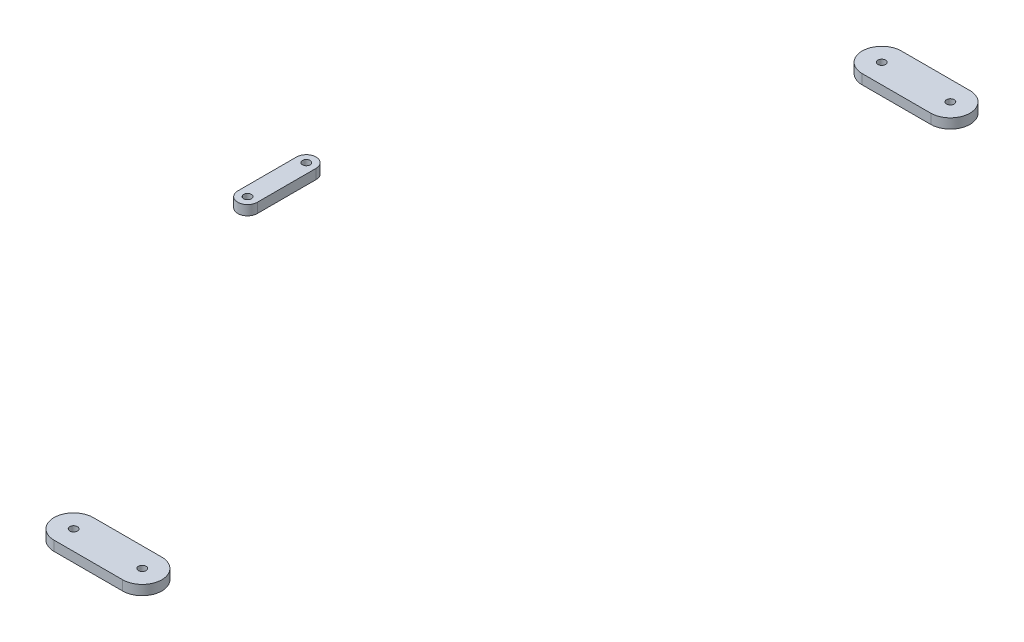
ISO-10303-21;
HEADER;
FILE_DESCRIPTION(('STEP AP214'),'2;1');
FILE_NAME('part.step','',(''),(''),'','','');
FILE_SCHEMA(('AUTOMOTIVE_DESIGN { 1 0 10303 214 1 1 1 1 }'));
ENDSEC;
DATA;
#1=APPLICATION_CONTEXT('core data for automotive mechanical design processes');
#2=APPLICATION_PROTOCOL_DEFINITION('international standard','automotive_design',2000,#1);
#3=PRODUCT_CONTEXT('',#1,'mechanical');
#4=PRODUCT('Part','Part','',(#3));
#5=PRODUCT_RELATED_PRODUCT_CATEGORY('part','',(#4));
#6=PRODUCT_DEFINITION_FORMATION('','',#4);
#7=PRODUCT_DEFINITION_CONTEXT('part definition',#1,'design');
#8=PRODUCT_DEFINITION('design','',#6,#7);
#9=PRODUCT_DEFINITION_SHAPE('','',#8);
#10=(LENGTH_UNIT() NAMED_UNIT(*) SI_UNIT(.MILLI.,.METRE.));
#11=(NAMED_UNIT(*) PLANE_ANGLE_UNIT() SI_UNIT($,.RADIAN.));
#12=(NAMED_UNIT(*) SI_UNIT($,.STERADIAN.) SOLID_ANGLE_UNIT());
#13=UNCERTAINTY_MEASURE_WITH_UNIT(LENGTH_MEASURE(1.E-05),#10,'distance_accuracy_value','');
#14=(GEOMETRIC_REPRESENTATION_CONTEXT(3) GLOBAL_UNCERTAINTY_ASSIGNED_CONTEXT((#13)) GLOBAL_UNIT_ASSIGNED_CONTEXT((#10,
#11,#12)) REPRESENTATION_CONTEXT('',''));
#15=CARTESIAN_POINT('',(0.,0.,0.));
#16=DIRECTION('',(0.,0.,1.));
#17=DIRECTION('',(1.,0.,0.));
#18=AXIS2_PLACEMENT_3D('',#15,#16,#17);
#19=CARTESIAN_POINT('',(0.,-342.9,-249.2375));
#20=DIRECTION('',(0.,0.,1.));
#21=DIRECTION('',(-1.,0.,0.));
#22=AXIS2_PLACEMENT_3D('',#19,#20,#21);
#23=PLANE('',#22);
#24=DIRECTION('',(-1.,0.,0.));
#25=VECTOR('',#24,1.);
#26=CARTESIAN_POINT('',(0.,-336.55,-249.2375));
#27=LINE('',#26,#25);
#28=CARTESIAN_POINT('',(174.625,-336.55,-249.2375));
#29=VERTEX_POINT('',#28);
#30=CARTESIAN_POINT('',(130.175,-336.55,-249.2375));
#31=VERTEX_POINT('',#30);
#32=EDGE_CURVE('E112',#29,#31,#27,.T.);
#33=ORIENTED_EDGE('',*,*,#32,.T.);
#34=DIRECTION('',(0.,1.,0.));
#35=VECTOR('',#34,1.);
#36=CARTESIAN_POINT('',(130.175,-342.9,-249.2375));
#37=LINE('',#36,#35);
#38=CARTESIAN_POINT('',(130.175,-342.9,-249.2375));
#39=VERTEX_POINT('',#38);
#40=EDGE_CURVE('E51',#39,#31,#37,.T.);
#41=ORIENTED_EDGE('',*,*,#40,.F.);
#42=DIRECTION('',(-1.,0.,0.));
#43=VECTOR('',#42,1.);
#44=CARTESIAN_POINT('',(0.,-342.9,-249.2375));
#45=LINE('',#44,#43);
#46=CARTESIAN_POINT('',(174.625,-342.9,-249.2375));
#47=VERTEX_POINT('',#46);
#48=EDGE_CURVE('E101',#47,#39,#45,.T.);
#49=ORIENTED_EDGE('',*,*,#48,.F.);
#50=DIRECTION('',(0.,1.,0.));
#51=VECTOR('',#50,1.);
#52=CARTESIAN_POINT('',(174.625,-342.9,-249.2375));
#53=LINE('',#52,#51);
#54=EDGE_CURVE('E12',#47,#29,#53,.T.);
#55=ORIENTED_EDGE('',*,*,#54,.T.);
#56=EDGE_LOOP('',(#33,#41,#49,#55));
#57=FACE_BOUND('',#56,.T.);
#58=ADVANCED_FACE('F48',(#57),#23,.T.);
#59=CARTESIAN_POINT('',(174.625,-342.9,-261.9375));
#60=DIRECTION('',(0.,1.,0.));
#61=DIRECTION('',(0.,0.,-1.));
#62=AXIS2_PLACEMENT_3D('',#59,#60,#61);
#63=CYLINDRICAL_SURFACE('',#62,12.7);
#64=CARTESIAN_POINT('',(174.625,-336.55,-261.9375));
#65=DIRECTION('',(0.,-1.,0.));
#66=DIRECTION('',(0.,0.,-1.));
#67=AXIS2_PLACEMENT_3D('',#64,#65,#66);
#68=CIRCLE('',#67,12.7);
#69=CARTESIAN_POINT('',(174.625,-336.55,-274.6375));
#70=VERTEX_POINT('',#69);
#71=EDGE_CURVE('E89',#70,#29,#68,.T.);
#72=ORIENTED_EDGE('',*,*,#71,.T.);
#73=ORIENTED_EDGE('',*,*,#54,.F.);
#74=CARTESIAN_POINT('',(174.625,-342.9,-261.9375));
#75=DIRECTION('',(0.,-1.,0.));
#76=DIRECTION('',(0.,0.,-1.));
#77=AXIS2_PLACEMENT_3D('',#74,#75,#76);
#78=CIRCLE('',#77,12.7);
#79=CARTESIAN_POINT('',(174.625,-342.9,-274.6375));
#80=VERTEX_POINT('',#79);
#81=EDGE_CURVE('E66',#80,#47,#78,.T.);
#82=ORIENTED_EDGE('',*,*,#81,.F.);
#83=DIRECTION('',(0.,1.,0.));
#84=VECTOR('',#83,1.);
#85=CARTESIAN_POINT('',(174.625,-342.9,-274.6375));
#86=LINE('',#85,#84);
#87=EDGE_CURVE('E57',#80,#70,#86,.T.);
#88=ORIENTED_EDGE('',*,*,#87,.T.);
#89=EDGE_LOOP('',(#72,#73,#82,#88));
#90=FACE_BOUND('',#89,.T.);
#91=ADVANCED_FACE('F119',(#90),#63,.T.);
#92=CARTESIAN_POINT('',(0.,-342.9,-274.6375));
#93=DIRECTION('',(0.,0.,1.));
#94=DIRECTION('',(-1.,0.,0.));
#95=AXIS2_PLACEMENT_3D('',#92,#93,#94);
#96=PLANE('',#95);
#97=DIRECTION('',(-1.,0.,0.));
#98=VECTOR('',#97,1.);
#99=CARTESIAN_POINT('',(0.,-336.55,-274.6375));
#100=LINE('',#99,#98);
#101=CARTESIAN_POINT('',(130.175,-336.55,-274.6375));
#102=VERTEX_POINT('',#101);
#103=EDGE_CURVE('E83',#70,#102,#100,.T.);
#104=ORIENTED_EDGE('',*,*,#103,.F.);
#105=ORIENTED_EDGE('',*,*,#87,.F.);
#106=DIRECTION('',(-1.,0.,0.));
#107=VECTOR('',#106,1.);
#108=CARTESIAN_POINT('',(0.,-342.9,-274.6375));
#109=LINE('',#108,#107);
#110=CARTESIAN_POINT('',(130.175,-342.9,-274.6375));
#111=VERTEX_POINT('',#110);
#112=EDGE_CURVE('E99',#80,#111,#109,.T.);
#113=ORIENTED_EDGE('',*,*,#112,.T.);
#114=DIRECTION('',(0.,1.,0.));
#115=VECTOR('',#114,1.);
#116=CARTESIAN_POINT('',(130.175,-342.9,-274.6375));
#117=LINE('',#116,#115);
#118=EDGE_CURVE('E104',#111,#102,#117,.T.);
#119=ORIENTED_EDGE('',*,*,#118,.T.);
#120=EDGE_LOOP('',(#104,#105,#113,#119));
#121=FACE_BOUND('',#120,.T.);
#122=ADVANCED_FACE('F107',(#121),#96,.F.);
#123=CARTESIAN_POINT('',(130.175,-342.9,-261.9375));
#124=DIRECTION('',(0.,1.,0.));
#125=DIRECTION('',(0.,0.,-1.));
#126=AXIS2_PLACEMENT_3D('',#123,#124,#125);
#127=CYLINDRICAL_SURFACE('',#126,12.7);
#128=CARTESIAN_POINT('',(130.175,-336.55,-261.9375));
#129=DIRECTION('',(0.,-1.,0.));
#130=DIRECTION('',(0.,0.,-1.));
#131=AXIS2_PLACEMENT_3D('',#128,#129,#130);
#132=CIRCLE('',#131,12.7);
#133=EDGE_CURVE('E106',#31,#102,#132,.T.);
#134=ORIENTED_EDGE('',*,*,#133,.T.);
#135=ORIENTED_EDGE('',*,*,#118,.F.);
#136=CARTESIAN_POINT('',(130.175,-342.9,-261.9375));
#137=DIRECTION('',(0.,-1.,0.));
#138=DIRECTION('',(0.,0.,-1.));
#139=AXIS2_PLACEMENT_3D('',#136,#137,#138);
#140=CIRCLE('',#139,12.7);
#141=EDGE_CURVE('E96',#39,#111,#140,.T.);
#142=ORIENTED_EDGE('',*,*,#141,.F.);
#143=ORIENTED_EDGE('',*,*,#40,.T.);
#144=EDGE_LOOP('',(#134,#135,#142,#143));
#145=FACE_BOUND('',#144,.T.);
#146=ADVANCED_FACE('F105',(#145),#127,.T.);
#147=CARTESIAN_POINT('',(0.,-342.9,0.));
#148=DIRECTION('',(0.,1.,0.));
#149=DIRECTION('',(0.,0.,-1.));
#150=AXIS2_PLACEMENT_3D('',#147,#148,#149);
#151=PLANE('',#150);
#152=CARTESIAN_POINT('',(174.625,-342.9,-261.9375));
#153=DIRECTION('',(0.,1.,0.));
#154=DIRECTION('',(0.,0.,1.));
#155=AXIS2_PLACEMENT_3D('',#152,#153,#154);
#156=CIRCLE('',#155,2.4892);
#157=CARTESIAN_POINT('',(174.625,-342.9,-259.4483));
#158=VERTEX_POINT('',#157);
#159=EDGE_CURVE('E130',#158,#158,#156,.T.);
#160=ORIENTED_EDGE('',*,*,#159,.T.);
#161=EDGE_LOOP('',(#160));
#162=FACE_BOUND('',#161,.T.);
#163=CARTESIAN_POINT('',(130.175,-342.9,-261.9375));
#164=DIRECTION('',(0.,1.,0.));
#165=DIRECTION('',(0.,0.,1.));
#166=AXIS2_PLACEMENT_3D('',#163,#164,#165);
#167=CIRCLE('',#166,2.4892);
#168=CARTESIAN_POINT('',(130.175,-342.9,-259.4483));
#169=VERTEX_POINT('',#168);
#170=EDGE_CURVE('E115',#169,#169,#167,.T.);
#171=ORIENTED_EDGE('',*,*,#170,.T.);
#172=EDGE_LOOP('',(#171));
#173=FACE_BOUND('',#172,.T.);
#174=ORIENTED_EDGE('',*,*,#48,.T.);
#175=ORIENTED_EDGE('',*,*,#141,.T.);
#176=ORIENTED_EDGE('',*,*,#112,.F.);
#177=ORIENTED_EDGE('',*,*,#81,.T.);
#178=EDGE_LOOP('',(#174,#175,#176,#177));
#179=FACE_BOUND('',#178,.T.);
#180=ADVANCED_FACE('F97',(#162,#173,#179),#151,.F.);
#181=CARTESIAN_POINT('',(0.,-336.55,0.));
#182=DIRECTION('',(0.,1.,0.));
#183=DIRECTION('',(0.,0.,-1.));
#184=AXIS2_PLACEMENT_3D('',#181,#182,#183);
#185=PLANE('',#184);
#186=CARTESIAN_POINT('',(174.625,-336.55,-261.9375));
#187=DIRECTION('',(0.,1.,0.));
#188=DIRECTION('',(0.,0.,1.));
#189=AXIS2_PLACEMENT_3D('',#186,#187,#188);
#190=CIRCLE('',#189,2.4892);
#191=CARTESIAN_POINT('',(174.625,-336.55,-259.4483));
#192=VERTEX_POINT('',#191);
#193=EDGE_CURVE('E133',#192,#192,#190,.T.);
#194=ORIENTED_EDGE('',*,*,#193,.F.);
#195=EDGE_LOOP('',(#194));
#196=FACE_BOUND('',#195,.T.);
#197=CARTESIAN_POINT('',(130.175,-336.55,-261.9375));
#198=DIRECTION('',(0.,1.,0.));
#199=DIRECTION('',(0.,0.,1.));
#200=AXIS2_PLACEMENT_3D('',#197,#198,#199);
#201=CIRCLE('',#200,2.4892);
#202=CARTESIAN_POINT('',(130.175,-336.55,-259.4483));
#203=VERTEX_POINT('',#202);
#204=EDGE_CURVE('E127',#203,#203,#201,.T.);
#205=ORIENTED_EDGE('',*,*,#204,.F.);
#206=EDGE_LOOP('',(#205));
#207=FACE_BOUND('',#206,.T.);
#208=ORIENTED_EDGE('',*,*,#32,.F.);
#209=ORIENTED_EDGE('',*,*,#71,.F.);
#210=ORIENTED_EDGE('',*,*,#103,.T.);
#211=ORIENTED_EDGE('',*,*,#133,.F.);
#212=EDGE_LOOP('',(#208,#209,#210,#211));
#213=FACE_BOUND('',#212,.T.);
#214=ADVANCED_FACE('F122',(#196,#207,#213),#185,.T.);
#215=CARTESIAN_POINT('',(130.175,-336.55,-261.9375));
#216=DIRECTION('',(0.,1.,0.));
#217=DIRECTION('',(0.,0.,1.));
#218=AXIS2_PLACEMENT_3D('',#215,#216,#217);
#219=CYLINDRICAL_SURFACE('',#218,2.4892);
#220=ORIENTED_EDGE('',*,*,#170,.F.);
#221=EDGE_LOOP('',(#220));
#222=FACE_BOUND('',#221,.T.);
#223=ORIENTED_EDGE('',*,*,#204,.T.);
#224=EDGE_LOOP('',(#223));
#225=FACE_BOUND('',#224,.T.);
#226=ADVANCED_FACE('F141',(#222,#225),#219,.F.);
#227=CARTESIAN_POINT('',(174.625,-336.55,-261.9375));
#228=DIRECTION('',(0.,1.,0.));
#229=DIRECTION('',(0.,0.,1.));
#230=AXIS2_PLACEMENT_3D('',#227,#228,#229);
#231=CYLINDRICAL_SURFACE('',#230,2.4892);
#232=ORIENTED_EDGE('',*,*,#159,.F.);
#233=EDGE_LOOP('',(#232));
#234=FACE_BOUND('',#233,.T.);
#235=ORIENTED_EDGE('',*,*,#193,.T.);
#236=EDGE_LOOP('',(#235));
#237=FACE_BOUND('',#236,.T.);
#238=ADVANCED_FACE('F137',(#234,#237),#231,.F.);
#239=CLOSED_SHELL('',(#58,#91,#122,#146,#180,#214,#226,#238));
#240=MANIFOLD_SOLID_BREP('B2',#239);
#241=CARTESIAN_POINT('',(0.,-342.9,19.05));
#242=DIRECTION('',(0.,1.,0.));
#243=DIRECTION('',(0.,0.,1.));
#244=AXIS2_PLACEMENT_3D('',#241,#242,#243);
#245=CYLINDRICAL_SURFACE('',#244,6.35);
#246=CARTESIAN_POINT('',(0.,-336.55,19.05));
#247=DIRECTION('',(0.,1.,0.));
#248=DIRECTION('',(0.,0.,1.));
#249=AXIS2_PLACEMENT_3D('',#246,#247,#248);
#250=CIRCLE('',#249,6.35);
#251=CARTESIAN_POINT('',(-6.35,-336.55,19.05));
#252=VERTEX_POINT('',#251);
#253=CARTESIAN_POINT('',(6.35,-336.55,19.05));
#254=VERTEX_POINT('',#253);
#255=EDGE_CURVE('E46',#252,#254,#250,.T.);
#256=ORIENTED_EDGE('',*,*,#255,.F.);
#257=DIRECTION('',(0.,1.,0.));
#258=VECTOR('',#257,1.);
#259=CARTESIAN_POINT('',(-6.35,-342.9,19.05));
#260=LINE('',#259,#258);
#261=CARTESIAN_POINT('',(-6.35,-342.9,19.05));
#262=VERTEX_POINT('',#261);
#263=EDGE_CURVE('E294',#262,#252,#260,.T.);
#264=ORIENTED_EDGE('',*,*,#263,.F.);
#265=CARTESIAN_POINT('',(0.,-342.9,19.05));
#266=DIRECTION('',(0.,1.,0.));
#267=DIRECTION('',(0.,0.,1.));
#268=AXIS2_PLACEMENT_3D('',#265,#266,#267);
#269=CIRCLE('',#268,6.35);
#270=CARTESIAN_POINT('',(6.35,-342.9,19.05));
#271=VERTEX_POINT('',#270);
#272=EDGE_CURVE('E251',#262,#271,#269,.T.);
#273=ORIENTED_EDGE('',*,*,#272,.T.);
#274=DIRECTION('',(0.,1.,0.));
#275=VECTOR('',#274,1.);
#276=CARTESIAN_POINT('',(6.35,-342.9,19.05));
#277=LINE('',#276,#275);
#278=EDGE_CURVE('E266',#271,#254,#277,.T.);
#279=ORIENTED_EDGE('',*,*,#278,.T.);
#280=EDGE_LOOP('',(#256,#264,#273,#279));
#281=FACE_BOUND('',#280,.T.);
#282=ADVANCED_FACE('F247',(#281),#245,.T.);
#283=CARTESIAN_POINT('',(-6.35,-342.9,19.05));
#284=DIRECTION('',(1.,0.,0.));
#285=DIRECTION('',(0.,0.,-1.));
#286=AXIS2_PLACEMENT_3D('',#283,#284,#285);
#287=PLANE('',#286);
#288=DIRECTION('',(0.,0.,-1.));
#289=VECTOR('',#288,1.);
#290=CARTESIAN_POINT('',(-6.35,-336.55,19.05));
#291=LINE('',#290,#289);
#292=CARTESIAN_POINT('',(-6.35000000000001,-336.55,-19.05));
#293=VERTEX_POINT('',#292);
#294=EDGE_CURVE('E305',#252,#293,#291,.T.);
#295=ORIENTED_EDGE('',*,*,#294,.T.);
#296=DIRECTION('',(0.,1.,0.));
#297=VECTOR('',#296,1.);
#298=CARTESIAN_POINT('',(-6.35000000000001,-342.9,-19.05));
#299=LINE('',#298,#297);
#300=CARTESIAN_POINT('',(-6.35000000000001,-342.9,-19.05));
#301=VERTEX_POINT('',#300);
#302=EDGE_CURVE('E298',#301,#293,#299,.T.);
#303=ORIENTED_EDGE('',*,*,#302,.F.);
#304=DIRECTION('',(0.,0.,-1.));
#305=VECTOR('',#304,1.);
#306=CARTESIAN_POINT('',(-6.35,-342.9,19.05));
#307=LINE('',#306,#305);
#308=EDGE_CURVE('E314',#262,#301,#307,.T.);
#309=ORIENTED_EDGE('',*,*,#308,.F.);
#310=ORIENTED_EDGE('',*,*,#263,.T.);
#311=EDGE_LOOP('',(#295,#303,#309,#310));
#312=FACE_BOUND('',#311,.T.);
#313=ADVANCED_FACE('F306',(#312),#287,.F.);
#314=CARTESIAN_POINT('',(0.,-342.9,-19.05));
#315=DIRECTION('',(0.,1.,0.));
#316=DIRECTION('',(0.,0.,1.));
#317=AXIS2_PLACEMENT_3D('',#314,#315,#316);
#318=CYLINDRICAL_SURFACE('',#317,6.35);
#319=CARTESIAN_POINT('',(0.,-336.55,-19.05));
#320=DIRECTION('',(0.,1.,0.));
#321=DIRECTION('',(0.,0.,1.));
#322=AXIS2_PLACEMENT_3D('',#319,#320,#321);
#323=CIRCLE('',#322,6.35);
#324=CARTESIAN_POINT('',(6.34999999999999,-336.55,-19.05));
#325=VERTEX_POINT('',#324);
#326=EDGE_CURVE('E301',#325,#293,#323,.T.);
#327=ORIENTED_EDGE('',*,*,#326,.F.);
#328=DIRECTION('',(0.,1.,0.));
#329=VECTOR('',#328,1.);
#330=CARTESIAN_POINT('',(6.34999999999999,-342.9,-19.05));
#331=LINE('',#330,#329);
#332=CARTESIAN_POINT('',(6.34999999999999,-342.9,-19.05));
#333=VERTEX_POINT('',#332);
#334=EDGE_CURVE('E283',#333,#325,#331,.T.);
#335=ORIENTED_EDGE('',*,*,#334,.F.);
#336=CARTESIAN_POINT('',(0.,-342.9,-19.05));
#337=DIRECTION('',(0.,1.,0.));
#338=DIRECTION('',(0.,0.,1.));
#339=AXIS2_PLACEMENT_3D('',#336,#337,#338);
#340=CIRCLE('',#339,6.35);
#341=EDGE_CURVE('E303',#333,#301,#340,.T.);
#342=ORIENTED_EDGE('',*,*,#341,.T.);
#343=ORIENTED_EDGE('',*,*,#302,.T.);
#344=EDGE_LOOP('',(#327,#335,#342,#343));
#345=FACE_BOUND('',#344,.T.);
#346=ADVANCED_FACE('F299',(#345),#318,.T.);
#347=CARTESIAN_POINT('',(6.35,-342.9,19.05));
#348=DIRECTION('',(1.,0.,0.));
#349=DIRECTION('',(0.,0.,-1.));
#350=AXIS2_PLACEMENT_3D('',#347,#348,#349);
#351=PLANE('',#350);
#352=DIRECTION('',(0.,0.,-1.));
#353=VECTOR('',#352,1.);
#354=CARTESIAN_POINT('',(6.35,-336.55,19.05));
#355=LINE('',#354,#353);
#356=EDGE_CURVE('E257',#254,#325,#355,.T.);
#357=ORIENTED_EDGE('',*,*,#356,.F.);
#358=ORIENTED_EDGE('',*,*,#278,.F.);
#359=DIRECTION('',(0.,0.,-1.));
#360=VECTOR('',#359,1.);
#361=CARTESIAN_POINT('',(6.35,-342.9,19.05));
#362=LINE('',#361,#360);
#363=EDGE_CURVE('E316',#271,#333,#362,.T.);
#364=ORIENTED_EDGE('',*,*,#363,.T.);
#365=ORIENTED_EDGE('',*,*,#334,.T.);
#366=EDGE_LOOP('',(#357,#358,#364,#365));
#367=FACE_BOUND('',#366,.T.);
#368=ADVANCED_FACE('F320',(#367),#351,.T.);
#369=CARTESIAN_POINT('',(0.,-342.9,19.05));
#370=DIRECTION('',(0.,1.,0.));
#371=DIRECTION('',(0.,0.,1.));
#372=AXIS2_PLACEMENT_3D('',#369,#370,#371);
#373=PLANE('',#372);
#374=CARTESIAN_POINT('',(0.,-342.9,19.05));
#375=DIRECTION('',(0.,1.,0.));
#376=DIRECTION('',(0.,0.,1.));
#377=AXIS2_PLACEMENT_3D('',#374,#375,#376);
#378=CIRCLE('',#377,2.4892);
#379=CARTESIAN_POINT('',(0.,-342.9,21.5392));
#380=VERTEX_POINT('',#379);
#381=EDGE_CURVE('E382',#380,#380,#378,.T.);
#382=ORIENTED_EDGE('',*,*,#381,.T.);
#383=EDGE_LOOP('',(#382));
#384=FACE_BOUND('',#383,.T.);
#385=CARTESIAN_POINT('',(0.,-342.9,-19.05));
#386=DIRECTION('',(0.,1.,0.));
#387=DIRECTION('',(0.,0.,1.));
#388=AXIS2_PLACEMENT_3D('',#385,#386,#387);
#389=CIRCLE('',#388,2.4892);
#390=CARTESIAN_POINT('',(0.,-342.9,-16.5608));
#391=VERTEX_POINT('',#390);
#392=EDGE_CURVE('E392',#391,#391,#389,.T.);
#393=ORIENTED_EDGE('',*,*,#392,.T.);
#394=EDGE_LOOP('',(#393));
#395=FACE_BOUND('',#394,.T.);
#396=ORIENTED_EDGE('',*,*,#272,.F.);
#397=ORIENTED_EDGE('',*,*,#308,.T.);
#398=ORIENTED_EDGE('',*,*,#341,.F.);
#399=ORIENTED_EDGE('',*,*,#363,.F.);
#400=EDGE_LOOP('',(#396,#397,#398,#399));
#401=FACE_BOUND('',#400,.T.);
#402=ADVANCED_FACE('F249',(#384,#395,#401),#373,.F.);
#403=CARTESIAN_POINT('',(0.,-336.55,19.05));
#404=DIRECTION('',(0.,1.,0.));
#405=DIRECTION('',(0.,0.,1.));
#406=AXIS2_PLACEMENT_3D('',#403,#404,#405);
#407=PLANE('',#406);
#408=CARTESIAN_POINT('',(0.,-336.55,19.05));
#409=DIRECTION('',(0.,1.,0.));
#410=DIRECTION('',(0.,0.,1.));
#411=AXIS2_PLACEMENT_3D('',#408,#409,#410);
#412=CIRCLE('',#411,2.48919999999999);
#413=CARTESIAN_POINT('',(0.,-336.55,21.5392));
#414=VERTEX_POINT('',#413);
#415=EDGE_CURVE('E385',#414,#414,#412,.T.);
#416=ORIENTED_EDGE('',*,*,#415,.F.);
#417=EDGE_LOOP('',(#416));
#418=FACE_BOUND('',#417,.T.);
#419=CARTESIAN_POINT('',(0.,-336.55,-19.05));
#420=DIRECTION('',(0.,1.,0.));
#421=DIRECTION('',(0.,0.,1.));
#422=AXIS2_PLACEMENT_3D('',#419,#420,#421);
#423=CIRCLE('',#422,2.48919999999999);
#424=CARTESIAN_POINT('',(0.,-336.55,-16.5608));
#425=VERTEX_POINT('',#424);
#426=EDGE_CURVE('E387',#425,#425,#423,.T.);
#427=ORIENTED_EDGE('',*,*,#426,.F.);
#428=EDGE_LOOP('',(#427));
#429=FACE_BOUND('',#428,.T.);
#430=ORIENTED_EDGE('',*,*,#255,.T.);
#431=ORIENTED_EDGE('',*,*,#356,.T.);
#432=ORIENTED_EDGE('',*,*,#326,.T.);
#433=ORIENTED_EDGE('',*,*,#294,.F.);
#434=EDGE_LOOP('',(#430,#431,#432,#433));
#435=FACE_BOUND('',#434,.T.);
#436=ADVANCED_FACE('F309',(#418,#429,#435),#407,.T.);
#437=CARTESIAN_POINT('',(0.,-336.55,-19.05));
#438=DIRECTION('',(0.,1.,0.));
#439=DIRECTION('',(0.,0.,1.));
#440=AXIS2_PLACEMENT_3D('',#437,#438,#439);
#441=CYLINDRICAL_SURFACE('',#440,2.48919999999999);
#442=ORIENTED_EDGE('',*,*,#392,.F.);
#443=EDGE_LOOP('',(#442));
#444=FACE_BOUND('',#443,.T.);
#445=ORIENTED_EDGE('',*,*,#426,.T.);
#446=EDGE_LOOP('',(#445));
#447=FACE_BOUND('',#446,.T.);
#448=ADVANCED_FACE('F326',(#444,#447),#441,.F.);
#449=CARTESIAN_POINT('',(0.,-336.55,19.05));
#450=DIRECTION('',(0.,1.,0.));
#451=DIRECTION('',(0.,0.,1.));
#452=AXIS2_PLACEMENT_3D('',#449,#450,#451);
#453=CYLINDRICAL_SURFACE('',#452,2.48919999999999);
#454=ORIENTED_EDGE('',*,*,#381,.F.);
#455=EDGE_LOOP('',(#454));
#456=FACE_BOUND('',#455,.T.);
#457=ORIENTED_EDGE('',*,*,#415,.T.);
#458=EDGE_LOOP('',(#457));
#459=FACE_BOUND('',#458,.T.);
#460=ADVANCED_FACE('F368',(#456,#459),#453,.F.);
#461=CLOSED_SHELL('',(#282,#313,#346,#368,#402,#436,#448,#460));
#462=MANIFOLD_SOLID_BREP('B6',#461);
#463=CARTESIAN_POINT('',(0.,-342.9,249.2375));
#464=DIRECTION('',(0.,0.,-1.));
#465=DIRECTION('',(-1.,0.,0.));
#466=AXIS2_PLACEMENT_3D('',#463,#464,#465);
#467=PLANE('',#466);
#468=DIRECTION('',(-1.,0.,0.));
#469=VECTOR('',#468,1.);
#470=CARTESIAN_POINT('',(0.,-336.55,249.2375));
#471=LINE('',#470,#469);
#472=CARTESIAN_POINT('',(174.625,-336.55,249.2375));
#473=VERTEX_POINT('',#472);
#474=CARTESIAN_POINT('',(130.175,-336.55,249.2375));
#475=VERTEX_POINT('',#474);
#476=EDGE_CURVE('E478',#473,#475,#471,.T.);
#477=ORIENTED_EDGE('',*,*,#476,.F.);
#478=DIRECTION('',(0.,1.,0.));
#479=VECTOR('',#478,1.);
#480=CARTESIAN_POINT('',(174.625,-342.9,249.2375));
#481=LINE('',#480,#479);
#482=CARTESIAN_POINT('',(174.625,-342.9,249.2375));
#483=VERTEX_POINT('',#482);
#484=EDGE_CURVE('E245',#483,#473,#481,.T.);
#485=ORIENTED_EDGE('',*,*,#484,.F.);
#486=DIRECTION('',(-1.,0.,0.));
#487=VECTOR('',#486,1.);
#488=CARTESIAN_POINT('',(0.,-342.9,249.2375));
#489=LINE('',#488,#487);
#490=CARTESIAN_POINT('',(130.175,-342.9,249.2375));
#491=VERTEX_POINT('',#490);
#492=EDGE_CURVE('E471',#483,#491,#489,.T.);
#493=ORIENTED_EDGE('',*,*,#492,.T.);
#494=DIRECTION('',(0.,1.,0.));
#495=VECTOR('',#494,1.);
#496=CARTESIAN_POINT('',(130.175,-342.9,249.2375));
#497=LINE('',#496,#495);
#498=EDGE_CURVE('E416',#491,#475,#497,.T.);
#499=ORIENTED_EDGE('',*,*,#498,.T.);
#500=EDGE_LOOP('',(#477,#485,#493,#499));
#501=FACE_BOUND('',#500,.T.);
#502=ADVANCED_FACE('F413',(#501),#467,.T.);
#503=CARTESIAN_POINT('',(174.625,-342.9,261.9375));
#504=DIRECTION('',(0.,1.,0.));
#505=DIRECTION('',(0.,0.,1.));
#506=AXIS2_PLACEMENT_3D('',#503,#504,#505);
#507=CYLINDRICAL_SURFACE('',#506,12.7);
#508=CARTESIAN_POINT('',(174.625,-336.55,261.9375));
#509=DIRECTION('',(0.,1.,0.));
#510=DIRECTION('',(0.,0.,1.));
#511=AXIS2_PLACEMENT_3D('',#508,#509,#510);
#512=CIRCLE('',#511,12.7);
#513=CARTESIAN_POINT('',(174.625,-336.55,274.6375));
#514=VERTEX_POINT('',#513);
#515=EDGE_CURVE('E473',#514,#473,#512,.T.);
#516=ORIENTED_EDGE('',*,*,#515,.F.);
#517=DIRECTION('',(0.,1.,0.));
#518=VECTOR('',#517,1.);
#519=CARTESIAN_POINT('',(174.625,-342.9,274.6375));
#520=LINE('',#519,#518);
#521=CARTESIAN_POINT('',(174.625,-342.9,274.6375));
#522=VERTEX_POINT('',#521);
#523=EDGE_CURVE('E422',#522,#514,#520,.T.);
#524=ORIENTED_EDGE('',*,*,#523,.F.);
#525=CARTESIAN_POINT('',(174.625,-342.9,261.9375));
#526=DIRECTION('',(0.,1.,0.));
#527=DIRECTION('',(0.,0.,1.));
#528=AXIS2_PLACEMENT_3D('',#525,#526,#527);
#529=CIRCLE('',#528,12.7);
#530=EDGE_CURVE('E464',#522,#483,#529,.T.);
#531=ORIENTED_EDGE('',*,*,#530,.T.);
#532=ORIENTED_EDGE('',*,*,#484,.T.);
#533=EDGE_LOOP('',(#516,#524,#531,#532));
#534=FACE_BOUND('',#533,.T.);
#535=ADVANCED_FACE('F489',(#534),#507,.T.);
#536=CARTESIAN_POINT('',(0.,-342.9,274.6375));
#537=DIRECTION('',(0.,0.,-1.));
#538=DIRECTION('',(-1.,0.,0.));
#539=AXIS2_PLACEMENT_3D('',#536,#537,#538);
#540=PLANE('',#539);
#541=DIRECTION('',(-1.,0.,0.));
#542=VECTOR('',#541,1.);
#543=CARTESIAN_POINT('',(0.,-336.55,274.6375));
#544=LINE('',#543,#542);
#545=CARTESIAN_POINT('',(130.175,-336.55,274.6375));
#546=VERTEX_POINT('',#545);
#547=EDGE_CURVE('E468',#514,#546,#544,.T.);
#548=ORIENTED_EDGE('',*,*,#547,.T.);
#549=DIRECTION('',(0.,1.,0.));
#550=VECTOR('',#549,1.);
#551=CARTESIAN_POINT('',(130.175,-342.9,274.6375));
#552=LINE('',#551,#550);
#553=CARTESIAN_POINT('',(130.175,-342.9,274.6375));
#554=VERTEX_POINT('',#553);
#555=EDGE_CURVE('E466',#554,#546,#552,.T.);
#556=ORIENTED_EDGE('',*,*,#555,.F.);
#557=DIRECTION('',(-1.,0.,0.));
#558=VECTOR('',#557,1.);
#559=CARTESIAN_POINT('',(0.,-342.9,274.6375));
#560=LINE('',#559,#558);
#561=EDGE_CURVE('E460',#522,#554,#560,.T.);
#562=ORIENTED_EDGE('',*,*,#561,.F.);
#563=ORIENTED_EDGE('',*,*,#523,.T.);
#564=EDGE_LOOP('',(#548,#556,#562,#563));
#565=FACE_BOUND('',#564,.T.);
#566=ADVANCED_FACE('F467',(#565),#540,.F.);
#567=CARTESIAN_POINT('',(130.175,-342.9,261.9375));
#568=DIRECTION('',(0.,1.,0.));
#569=DIRECTION('',(0.,0.,1.));
#570=AXIS2_PLACEMENT_3D('',#567,#568,#569);
#571=CYLINDRICAL_SURFACE('',#570,12.7);
#572=CARTESIAN_POINT('',(130.175,-336.55,261.9375));
#573=DIRECTION('',(0.,1.,0.));
#574=DIRECTION('',(0.,0.,1.));
#575=AXIS2_PLACEMENT_3D('',#572,#573,#574);
#576=CIRCLE('',#575,12.7);
#577=EDGE_CURVE('E481',#475,#546,#576,.T.);
#578=ORIENTED_EDGE('',*,*,#577,.F.);
#579=ORIENTED_EDGE('',*,*,#498,.F.);
#580=CARTESIAN_POINT('',(130.175,-342.9,261.9375));
#581=DIRECTION('',(0.,1.,0.));
#582=DIRECTION('',(0.,0.,1.));
#583=AXIS2_PLACEMENT_3D('',#580,#581,#582);
#584=CIRCLE('',#583,12.7);
#585=EDGE_CURVE('E463',#491,#554,#584,.T.);
#586=ORIENTED_EDGE('',*,*,#585,.T.);
#587=ORIENTED_EDGE('',*,*,#555,.T.);
#588=EDGE_LOOP('',(#578,#579,#586,#587));
#589=FACE_BOUND('',#588,.T.);
#590=ADVANCED_FACE('F470',(#589),#571,.T.);
#591=CARTESIAN_POINT('',(0.,-342.9,0.));
#592=DIRECTION('',(0.,1.,0.));
#593=DIRECTION('',(0.,0.,1.));
#594=AXIS2_PLACEMENT_3D('',#591,#592,#593);
#595=PLANE('',#594);
#596=CARTESIAN_POINT('',(174.625,-342.9,261.9375));
#597=DIRECTION('',(0.,1.,0.));
#598=DIRECTION('',(0.,0.,1.));
#599=AXIS2_PLACEMENT_3D('',#596,#597,#598);
#600=CIRCLE('',#599,2.4892);
#601=CARTESIAN_POINT('',(174.625,-342.9,264.4267));
#602=VERTEX_POINT('',#601);
#603=EDGE_CURVE('E522',#602,#602,#600,.T.);
#604=ORIENTED_EDGE('',*,*,#603,.T.);
#605=EDGE_LOOP('',(#604));
#606=FACE_BOUND('',#605,.T.);
#607=CARTESIAN_POINT('',(130.175,-342.9,261.9375));
#608=DIRECTION('',(0.,1.,0.));
#609=DIRECTION('',(0.,0.,1.));
#610=AXIS2_PLACEMENT_3D('',#607,#608,#609);
#611=CIRCLE('',#610,2.4892);
#612=CARTESIAN_POINT('',(130.175,-342.9,264.4267));
#613=VERTEX_POINT('',#612);
#614=EDGE_CURVE('E482',#613,#613,#611,.T.);
#615=ORIENTED_EDGE('',*,*,#614,.T.);
#616=EDGE_LOOP('',(#615));
#617=FACE_BOUND('',#616,.T.);
#618=ORIENTED_EDGE('',*,*,#492,.F.);
#619=ORIENTED_EDGE('',*,*,#530,.F.);
#620=ORIENTED_EDGE('',*,*,#561,.T.);
#621=ORIENTED_EDGE('',*,*,#585,.F.);
#622=EDGE_LOOP('',(#618,#619,#620,#621));
#623=FACE_BOUND('',#622,.T.);
#624=ADVANCED_FACE('F462',(#606,#617,#623),#595,.F.);
#625=CARTESIAN_POINT('',(0.,-336.55,0.));
#626=DIRECTION('',(0.,1.,0.));
#627=DIRECTION('',(0.,0.,1.));
#628=AXIS2_PLACEMENT_3D('',#625,#626,#627);
#629=PLANE('',#628);
#630=CARTESIAN_POINT('',(174.625,-336.55,261.9375));
#631=DIRECTION('',(0.,1.,0.));
#632=DIRECTION('',(0.,0.,1.));
#633=AXIS2_PLACEMENT_3D('',#630,#631,#632);
#634=CIRCLE('',#633,2.4892);
#635=CARTESIAN_POINT('',(174.625,-336.55,264.4267));
#636=VERTEX_POINT('',#635);
#637=EDGE_CURVE('E525',#636,#636,#634,.T.);
#638=ORIENTED_EDGE('',*,*,#637,.F.);
#639=EDGE_LOOP('',(#638));
#640=FACE_BOUND('',#639,.T.);
#641=CARTESIAN_POINT('',(130.175,-336.55,261.9375));
#642=DIRECTION('',(0.,1.,0.));
#643=DIRECTION('',(0.,0.,1.));
#644=AXIS2_PLACEMENT_3D('',#641,#642,#643);
#645=CIRCLE('',#644,2.4892);
#646=CARTESIAN_POINT('',(130.175,-336.55,264.4267));
#647=VERTEX_POINT('',#646);
#648=EDGE_CURVE('E527',#647,#647,#645,.T.);
#649=ORIENTED_EDGE('',*,*,#648,.F.);
#650=EDGE_LOOP('',(#649));
#651=FACE_BOUND('',#650,.T.);
#652=ORIENTED_EDGE('',*,*,#476,.T.);
#653=ORIENTED_EDGE('',*,*,#577,.T.);
#654=ORIENTED_EDGE('',*,*,#547,.F.);
#655=ORIENTED_EDGE('',*,*,#515,.T.);
#656=EDGE_LOOP('',(#652,#653,#654,#655));
#657=FACE_BOUND('',#656,.T.);
#658=ADVANCED_FACE('F488',(#640,#651,#657),#629,.T.);
#659=CARTESIAN_POINT('',(130.175,-336.55,261.9375));
#660=DIRECTION('',(0.,1.,0.));
#661=DIRECTION('',(0.,0.,1.));
#662=AXIS2_PLACEMENT_3D('',#659,#660,#661);
#663=CYLINDRICAL_SURFACE('',#662,2.4892);
#664=ORIENTED_EDGE('',*,*,#614,.F.);
#665=EDGE_LOOP('',(#664));
#666=FACE_BOUND('',#665,.T.);
#667=ORIENTED_EDGE('',*,*,#648,.T.);
#668=EDGE_LOOP('',(#667));
#669=FACE_BOUND('',#668,.T.);
#670=ADVANCED_FACE('F507',(#666,#669),#663,.F.);
#671=CARTESIAN_POINT('',(174.625,-336.55,261.9375));
#672=DIRECTION('',(0.,1.,0.));
#673=DIRECTION('',(0.,0.,1.));
#674=AXIS2_PLACEMENT_3D('',#671,#672,#673);
#675=CYLINDRICAL_SURFACE('',#674,2.4892);
#676=ORIENTED_EDGE('',*,*,#603,.F.);
#677=EDGE_LOOP('',(#676));
#678=FACE_BOUND('',#677,.T.);
#679=ORIENTED_EDGE('',*,*,#637,.T.);
#680=EDGE_LOOP('',(#679));
#681=FACE_BOUND('',#680,.T.);
#682=ADVANCED_FACE('F514',(#678,#681),#675,.F.);
#683=CLOSED_SHELL('',(#502,#535,#566,#590,#624,#658,#670,#682));
#684=MANIFOLD_SOLID_BREP('B40',#683);
#685=ADVANCED_BREP_SHAPE_REPRESENTATION('',(#18,#240,#462,#684),#14);
#686=SHAPE_DEFINITION_REPRESENTATION(#9,#685);
ENDSEC;
END-ISO-10303-21;
